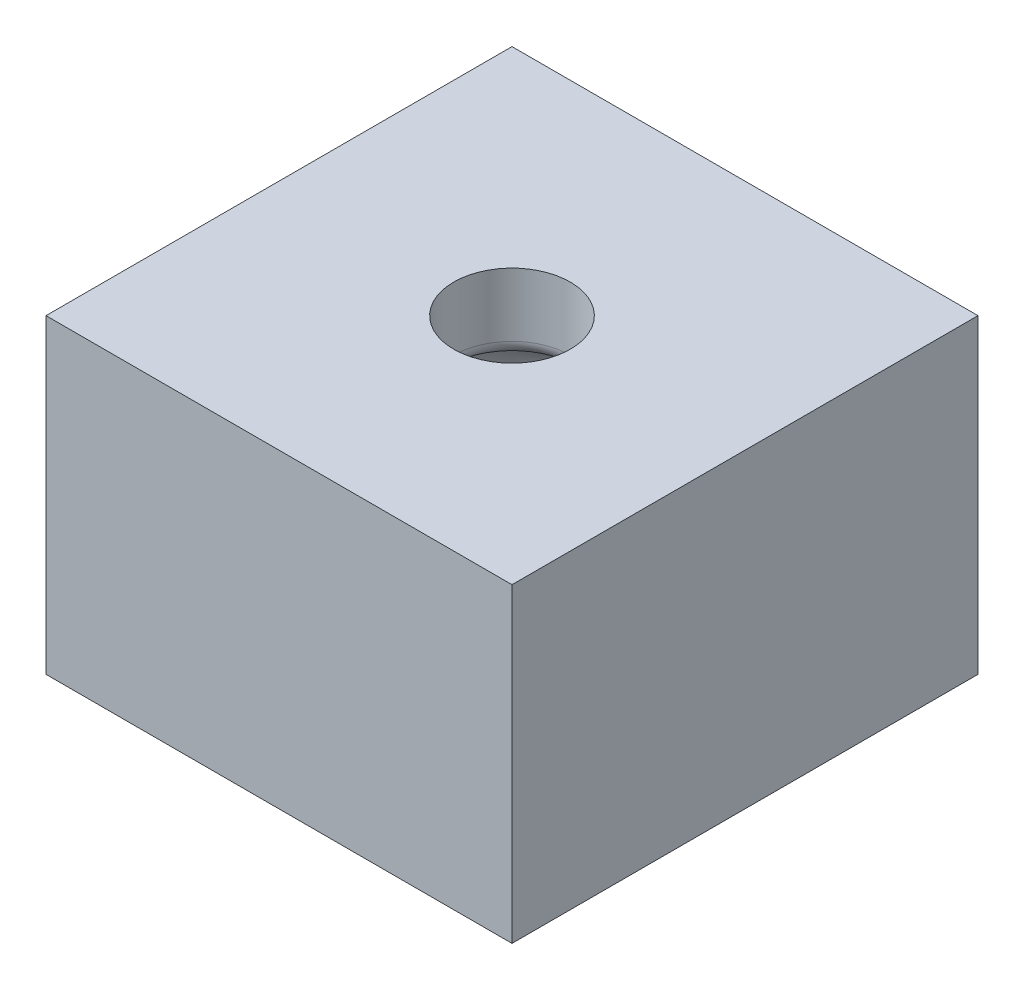
ISO-10303-21;
HEADER;
FILE_DESCRIPTION(('STEP AP214'),'2;1');
FILE_NAME('part.step','',(''),(''),'','','');
FILE_SCHEMA(('AUTOMOTIVE_DESIGN { 1 0 10303 214 1 1 1 1 }'));
ENDSEC;
DATA;
#1=APPLICATION_CONTEXT('core data for automotive mechanical design processes');
#2=APPLICATION_PROTOCOL_DEFINITION('international standard','automotive_design',2000,#1);
#3=PRODUCT_CONTEXT('',#1,'mechanical');
#4=PRODUCT('Part','Part','',(#3));
#5=PRODUCT_RELATED_PRODUCT_CATEGORY('part','',(#4));
#6=PRODUCT_DEFINITION_FORMATION('','',#4);
#7=PRODUCT_DEFINITION_CONTEXT('part definition',#1,'design');
#8=PRODUCT_DEFINITION('design','',#6,#7);
#9=PRODUCT_DEFINITION_SHAPE('','',#8);
#10=(LENGTH_UNIT() NAMED_UNIT(*) SI_UNIT(.MILLI.,.METRE.));
#11=(NAMED_UNIT(*) PLANE_ANGLE_UNIT() SI_UNIT($,.RADIAN.));
#12=(NAMED_UNIT(*) SI_UNIT($,.STERADIAN.) SOLID_ANGLE_UNIT());
#13=UNCERTAINTY_MEASURE_WITH_UNIT(LENGTH_MEASURE(1.E-05),#10,'distance_accuracy_value','');
#14=(GEOMETRIC_REPRESENTATION_CONTEXT(3) GLOBAL_UNCERTAINTY_ASSIGNED_CONTEXT((#13)) GLOBAL_UNIT_ASSIGNED_CONTEXT((#10,
#11,#12)) REPRESENTATION_CONTEXT('',''));
#15=CARTESIAN_POINT('',(0.,0.,0.));
#16=DIRECTION('',(0.,0.,1.));
#17=DIRECTION('',(1.,0.,0.));
#18=AXIS2_PLACEMENT_3D('',#15,#16,#17);
#19=CARTESIAN_POINT('',(76.2,101.6,76.2));
#20=DIRECTION('',(-1.,0.,0.));
#21=DIRECTION('',(0.,0.,1.));
#22=AXIS2_PLACEMENT_3D('',#19,#20,#21);
#23=PLANE('',#22);
#24=DIRECTION('',(0.,0.,-1.));
#25=VECTOR('',#24,1.);
#26=CARTESIAN_POINT('',(76.2,0.,76.2));
#27=LINE('',#26,#25);
#28=CARTESIAN_POINT('',(76.2,0.,76.2));
#29=VERTEX_POINT('',#28);
#30=CARTESIAN_POINT('',(76.2,0.,-76.2));
#31=VERTEX_POINT('',#30);
#32=EDGE_CURVE('E111',#29,#31,#27,.T.);
#33=ORIENTED_EDGE('',*,*,#32,.T.);
#34=DIRECTION('',(0.,-1.,0.));
#35=VECTOR('',#34,1.);
#36=CARTESIAN_POINT('',(76.2,101.6,-76.2));
#37=LINE('',#36,#35);
#38=CARTESIAN_POINT('',(76.2,101.6,-76.2));
#39=VERTEX_POINT('',#38);
#40=EDGE_CURVE('E11',#39,#31,#37,.T.);
#41=ORIENTED_EDGE('',*,*,#40,.F.);
#42=DIRECTION('',(0.,0.,-1.));
#43=VECTOR('',#42,1.);
#44=CARTESIAN_POINT('',(76.2,101.6,76.2));
#45=LINE('',#44,#43);
#46=CARTESIAN_POINT('',(76.2,101.6,76.2));
#47=VERTEX_POINT('',#46);
#48=EDGE_CURVE('E95',#47,#39,#45,.T.);
#49=ORIENTED_EDGE('',*,*,#48,.F.);
#50=DIRECTION('',(0.,-1.,0.));
#51=VECTOR('',#50,1.);
#52=CARTESIAN_POINT('',(76.2,101.6,76.2));
#53=LINE('',#52,#51);
#54=EDGE_CURVE('E107',#47,#29,#53,.T.);
#55=ORIENTED_EDGE('',*,*,#54,.T.);
#56=EDGE_LOOP('',(#33,#41,#49,#55));
#57=FACE_BOUND('',#56,.T.);
#58=ADVANCED_FACE('F43',(#57),#23,.F.);
#59=CARTESIAN_POINT('',(-76.2,101.6,-76.2));
#60=DIRECTION('',(0.,0.,1.));
#61=DIRECTION('',(1.,0.,0.));
#62=AXIS2_PLACEMENT_3D('',#59,#60,#61);
#63=PLANE('',#62);
#64=DIRECTION('',(-1.,0.,0.));
#65=VECTOR('',#64,1.);
#66=CARTESIAN_POINT('',(-76.2,0.,-76.2));
#67=LINE('',#66,#65);
#68=CARTESIAN_POINT('',(-76.2,0.,-76.2));
#69=VERTEX_POINT('',#68);
#70=EDGE_CURVE('E100',#31,#69,#67,.T.);
#71=ORIENTED_EDGE('',*,*,#70,.T.);
#72=DIRECTION('',(0.,-1.,0.));
#73=VECTOR('',#72,1.);
#74=CARTESIAN_POINT('',(-76.2,101.6,-76.2));
#75=LINE('',#74,#73);
#76=CARTESIAN_POINT('',(-76.2,101.6,-76.2));
#77=VERTEX_POINT('',#76);
#78=EDGE_CURVE('E52',#77,#69,#75,.T.);
#79=ORIENTED_EDGE('',*,*,#78,.F.);
#80=DIRECTION('',(-1.,0.,0.));
#81=VECTOR('',#80,1.);
#82=CARTESIAN_POINT('',(-76.2,101.6,-76.2));
#83=LINE('',#82,#81);
#84=EDGE_CURVE('E90',#39,#77,#83,.T.);
#85=ORIENTED_EDGE('',*,*,#84,.F.);
#86=ORIENTED_EDGE('',*,*,#40,.T.);
#87=EDGE_LOOP('',(#71,#79,#85,#86));
#88=FACE_BOUND('',#87,.T.);
#89=ADVANCED_FACE('F99',(#88),#63,.F.);
#90=CARTESIAN_POINT('',(-76.2,101.6,76.2));
#91=DIRECTION('',(1.,0.,0.));
#92=DIRECTION('',(0.,0.,-1.));
#93=AXIS2_PLACEMENT_3D('',#90,#91,#92);
#94=PLANE('',#93);
#95=DIRECTION('',(0.,0.,1.));
#96=VECTOR('',#95,1.);
#97=CARTESIAN_POINT('',(-76.2,0.,76.2));
#98=LINE('',#97,#96);
#99=CARTESIAN_POINT('',(-76.2,0.,76.2));
#100=VERTEX_POINT('',#99);
#101=EDGE_CURVE('E77',#69,#100,#98,.T.);
#102=ORIENTED_EDGE('',*,*,#101,.T.);
#103=DIRECTION('',(0.,-1.,0.));
#104=VECTOR('',#103,1.);
#105=CARTESIAN_POINT('',(-76.2,101.6,76.2));
#106=LINE('',#105,#104);
#107=CARTESIAN_POINT('',(-76.2,101.6,76.2));
#108=VERTEX_POINT('',#107);
#109=EDGE_CURVE('E102',#108,#100,#106,.T.);
#110=ORIENTED_EDGE('',*,*,#109,.F.);
#111=DIRECTION('',(0.,0.,1.));
#112=VECTOR('',#111,1.);
#113=CARTESIAN_POINT('',(-76.2,101.6,76.2));
#114=LINE('',#113,#112);
#115=EDGE_CURVE('E93',#77,#108,#114,.T.);
#116=ORIENTED_EDGE('',*,*,#115,.F.);
#117=ORIENTED_EDGE('',*,*,#78,.T.);
#118=EDGE_LOOP('',(#102,#110,#116,#117));
#119=FACE_BOUND('',#118,.T.);
#120=ADVANCED_FACE('F103',(#119),#94,.F.);
#121=CARTESIAN_POINT('',(-76.2,101.6,76.2));
#122=DIRECTION('',(0.,0.,-1.));
#123=DIRECTION('',(-1.,0.,0.));
#124=AXIS2_PLACEMENT_3D('',#121,#122,#123);
#125=PLANE('',#124);
#126=DIRECTION('',(1.,0.,0.));
#127=VECTOR('',#126,1.);
#128=CARTESIAN_POINT('',(-76.2,0.,76.2));
#129=LINE('',#128,#127);
#130=EDGE_CURVE('E83',#100,#29,#129,.T.);
#131=ORIENTED_EDGE('',*,*,#130,.T.);
#132=ORIENTED_EDGE('',*,*,#54,.F.);
#133=DIRECTION('',(1.,0.,0.));
#134=VECTOR('',#133,1.);
#135=CARTESIAN_POINT('',(-76.2,101.6,76.2));
#136=LINE('',#135,#134);
#137=EDGE_CURVE('E60',#108,#47,#136,.T.);
#138=ORIENTED_EDGE('',*,*,#137,.F.);
#139=ORIENTED_EDGE('',*,*,#109,.T.);
#140=EDGE_LOOP('',(#131,#132,#138,#139));
#141=FACE_BOUND('',#140,.T.);
#142=ADVANCED_FACE('F125',(#141),#125,.F.);
#143=CARTESIAN_POINT('',(0.,101.6,0.));
#144=DIRECTION('',(0.,-1.,0.));
#145=DIRECTION('',(0.,0.,-1.));
#146=AXIS2_PLACEMENT_3D('',#143,#144,#145);
#147=PLANE('',#146);
#148=CARTESIAN_POINT('',(0.,101.6,0.));
#149=DIRECTION('',(0.,1.,0.));
#150=DIRECTION('',(-1.,0.,0.));
#151=AXIS2_PLACEMENT_3D('',#148,#149,#150);
#152=CIRCLE('',#151,19.05);
#153=CARTESIAN_POINT('',(-19.05,101.6,0.));
#154=VERTEX_POINT('',#153);
#155=EDGE_CURVE('E143',#154,#154,#152,.T.);
#156=ORIENTED_EDGE('',*,*,#155,.F.);
#157=EDGE_LOOP('',(#156));
#158=FACE_BOUND('',#157,.T.);
#159=ORIENTED_EDGE('',*,*,#48,.T.);
#160=ORIENTED_EDGE('',*,*,#84,.T.);
#161=ORIENTED_EDGE('',*,*,#115,.T.);
#162=ORIENTED_EDGE('',*,*,#137,.T.);
#163=EDGE_LOOP('',(#159,#160,#161,#162));
#164=FACE_BOUND('',#163,.T.);
#165=ADVANCED_FACE('F91',(#158,#164),#147,.F.);
#166=CARTESIAN_POINT('',(0.,0.,0.));
#167=DIRECTION('',(0.,-1.,0.));
#168=DIRECTION('',(0.,0.,-1.));
#169=AXIS2_PLACEMENT_3D('',#166,#167,#168);
#170=PLANE('',#169);
#171=ORIENTED_EDGE('',*,*,#32,.F.);
#172=ORIENTED_EDGE('',*,*,#130,.F.);
#173=ORIENTED_EDGE('',*,*,#101,.F.);
#174=ORIENTED_EDGE('',*,*,#70,.F.);
#175=EDGE_LOOP('',(#171,#172,#173,#174));
#176=FACE_BOUND('',#175,.T.);
#177=ADVANCED_FACE('F128',(#176),#170,.T.);
#178=CARTESIAN_POINT('',(-19.05,25.4,0.));
#179=DIRECTION('',(0.,-1.,0.));
#180=DIRECTION('',(1.,0.,0.));
#181=AXIS2_PLACEMENT_3D('',#178,#179,#180);
#182=PLANE('',#181);
#183=CARTESIAN_POINT('',(0.,25.4,0.));
#184=DIRECTION('',(0.,1.,0.));
#185=DIRECTION('',(-1.,0.,0.));
#186=AXIS2_PLACEMENT_3D('',#183,#184,#185);
#187=CIRCLE('',#186,19.05);
#188=CARTESIAN_POINT('',(-19.05,25.4,0.));
#189=VERTEX_POINT('',#188);
#190=EDGE_CURVE('E115',#189,#189,#187,.T.);
#191=ORIENTED_EDGE('',*,*,#190,.T.);
#192=EDGE_LOOP('',(#191));
#193=FACE_BOUND('',#192,.T.);
#194=ADVANCED_FACE('F157',(#193),#182,.F.);
#195=CARTESIAN_POINT('',(0.,50.8,0.));
#196=DIRECTION('',(0.,1.,0.));
#197=DIRECTION('',(-1.,0.,0.));
#198=AXIS2_PLACEMENT_3D('',#195,#196,#197);
#199=DEGENERATE_TOROIDAL_SURFACE('',#198,19.05,25.4,.T.);
#200=CARTESIAN_POINT('',(0.,75.8447377484551,0.));
#201=DIRECTION('',(0.,1.,0.));
#202=DIRECTION('',(-1.,0.,0.));
#203=AXIS2_PLACEMENT_3D('',#200,#201,#202);
#204=CIRCLE('',#203,23.2833333333333);
#205=CARTESIAN_POINT('',(-23.2833333333333,75.8447377484551,0.));
#206=VERTEX_POINT('',#205);
#207=EDGE_CURVE('E135',#206,#206,#204,.T.);
#208=ORIENTED_EDGE('',*,*,#207,.T.);
#209=EDGE_LOOP('',(#208));
#210=FACE_BOUND('',#209,.T.);
#211=ORIENTED_EDGE('',*,*,#190,.F.);
#212=EDGE_LOOP('',(#211));
#213=FACE_BOUND('',#212,.T.);
#214=ADVANCED_FACE('F197',(#210,#213),#199,.F.);
#215=CARTESIAN_POINT('',(0.,80.8536852981461,0.));
#216=DIRECTION('',(0.,1.,0.));
#217=DIRECTION('',(-1.,0.,0.));
#218=AXIS2_PLACEMENT_3D('',#215,#216,#217);
#219=TOROIDAL_SURFACE('',#218,24.13,5.08000000000001);
#220=CARTESIAN_POINT('',(0.,80.8536852981461,0.));
#221=DIRECTION('',(0.,1.,0.));
#222=DIRECTION('',(-1.,0.,0.));
#223=AXIS2_PLACEMENT_3D('',#220,#221,#222);
#224=CIRCLE('',#223,19.05);
#225=CARTESIAN_POINT('',(-19.05,80.8536852981461,0.));
#226=VERTEX_POINT('',#225);
#227=EDGE_CURVE('E139',#226,#226,#224,.T.);
#228=ORIENTED_EDGE('',*,*,#227,.T.);
#229=EDGE_LOOP('',(#228));
#230=FACE_BOUND('',#229,.T.);
#231=ORIENTED_EDGE('',*,*,#207,.F.);
#232=EDGE_LOOP('',(#231));
#233=FACE_BOUND('',#232,.T.);
#234=ADVANCED_FACE('F207',(#230,#233),#219,.T.);
#235=CARTESIAN_POINT('',(0.,101.6,0.));
#236=DIRECTION('',(0.,1.,0.));
#237=DIRECTION('',(-1.,0.,0.));
#238=AXIS2_PLACEMENT_3D('',#235,#236,#237);
#239=CYLINDRICAL_SURFACE('',#238,19.05);
#240=ORIENTED_EDGE('',*,*,#155,.T.);
#241=EDGE_LOOP('',(#240));
#242=FACE_BOUND('',#241,.T.);
#243=ORIENTED_EDGE('',*,*,#227,.F.);
#244=EDGE_LOOP('',(#243));
#245=FACE_BOUND('',#244,.T.);
#246=ADVANCED_FACE('F148',(#242,#245),#239,.F.);
#247=CLOSED_SHELL('',(#58,#89,#120,#142,#165,#177,#194,#214,#234,#246));
#248=MANIFOLD_SOLID_BREP('B2',#247);
#249=ADVANCED_BREP_SHAPE_REPRESENTATION('',(#18,#248),#14);
#250=SHAPE_DEFINITION_REPRESENTATION(#9,#249);
ENDSEC;
END-ISO-10303-21;
